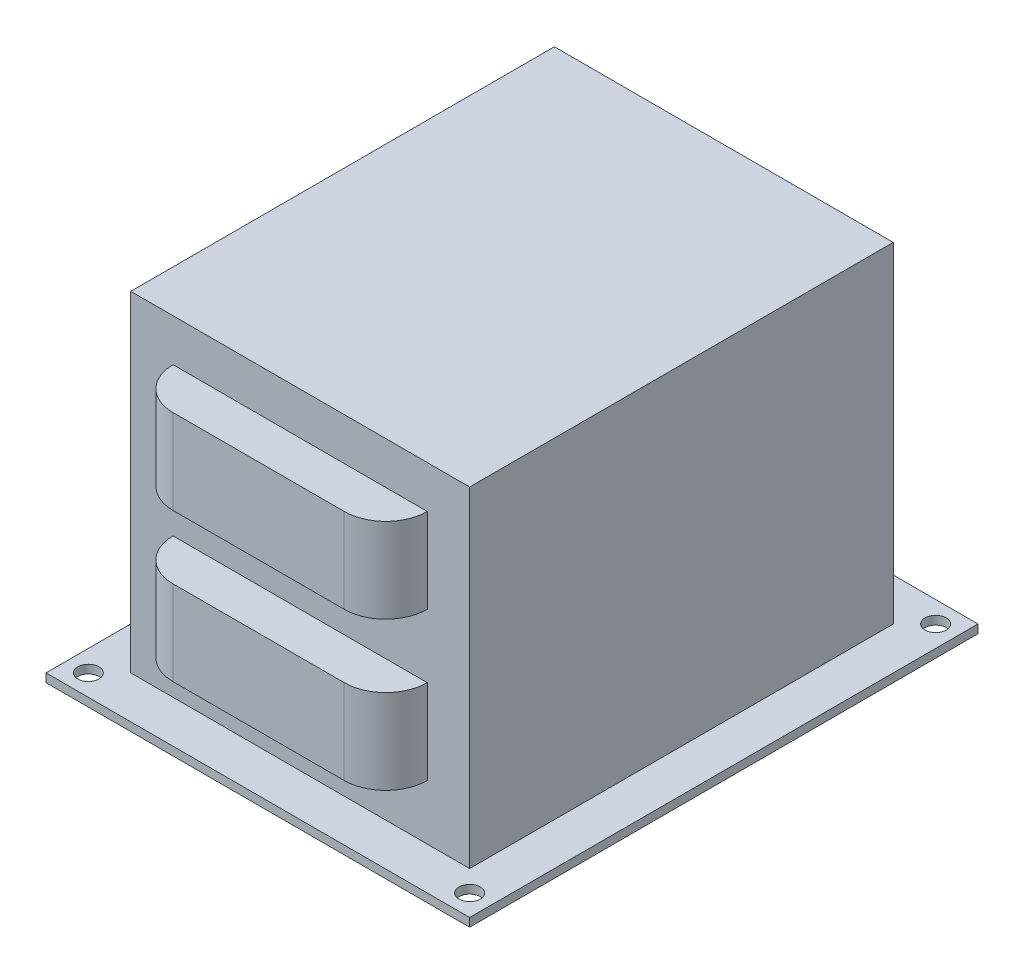
ISO-10303-21;
HEADER;
FILE_DESCRIPTION(('STEP AP214'),'2;1');
FILE_NAME('part.step','',(''),(''),'','','');
FILE_SCHEMA(('AUTOMOTIVE_DESIGN { 1 0 10303 214 1 1 1 1 }'));
ENDSEC;
DATA;
#1=APPLICATION_CONTEXT('core data for automotive mechanical design processes');
#2=APPLICATION_PROTOCOL_DEFINITION('international standard','automotive_design',2000,#1);
#3=PRODUCT_CONTEXT('',#1,'mechanical');
#4=PRODUCT('Part','Part','',(#3));
#5=PRODUCT_RELATED_PRODUCT_CATEGORY('part','',(#4));
#6=PRODUCT_DEFINITION_FORMATION('','',#4);
#7=PRODUCT_DEFINITION_CONTEXT('part definition',#1,'design');
#8=PRODUCT_DEFINITION('design','',#6,#7);
#9=PRODUCT_DEFINITION_SHAPE('','',#8);
#10=(LENGTH_UNIT() NAMED_UNIT(*) SI_UNIT(.MILLI.,.METRE.));
#11=(NAMED_UNIT(*) PLANE_ANGLE_UNIT() SI_UNIT($,.RADIAN.));
#12=(NAMED_UNIT(*) SI_UNIT($,.STERADIAN.) SOLID_ANGLE_UNIT());
#13=UNCERTAINTY_MEASURE_WITH_UNIT(LENGTH_MEASURE(1.E-05),#10,'distance_accuracy_value','');
#14=(GEOMETRIC_REPRESENTATION_CONTEXT(3) GLOBAL_UNCERTAINTY_ASSIGNED_CONTEXT((#13)) GLOBAL_UNIT_ASSIGNED_CONTEXT((#10,
#11,#12)) REPRESENTATION_CONTEXT('',''));
#15=CARTESIAN_POINT('',(0.,0.,0.));
#16=DIRECTION('',(0.,0.,1.));
#17=DIRECTION('',(1.,0.,0.));
#18=AXIS2_PLACEMENT_3D('',#15,#16,#17);
#19=CARTESIAN_POINT('',(0.,101.6,63.5));
#20=DIRECTION('',(0.,0.,-1.));
#21=DIRECTION('',(-1.,0.,0.));
#22=AXIS2_PLACEMENT_3D('',#19,#20,#21);
#23=PLANE('',#22);
#24=DIRECTION('',(0.,-1.,0.));
#25=VECTOR('',#24,1.);
#26=CARTESIAN_POINT('',(-38.0999999999999,44.45,63.5));
#27=LINE('',#26,#25);
#28=CARTESIAN_POINT('',(-38.0999999999999,44.45,63.5));
#29=VERTEX_POINT('',#28);
#30=CARTESIAN_POINT('',(-38.0999999999999,19.05,63.5));
#31=VERTEX_POINT('',#30);
#32=EDGE_CURVE('E67',#29,#31,#27,.T.);
#33=ORIENTED_EDGE('',*,*,#32,.F.);
#34=DIRECTION('',(1.,0.,0.));
#35=VECTOR('',#34,1.);
#36=CARTESIAN_POINT('',(0.,44.45,63.5));
#37=LINE('',#36,#35);
#38=CARTESIAN_POINT('',(38.1000000000001,44.45,63.5));
#39=VERTEX_POINT('',#38);
#40=EDGE_CURVE('E268',#29,#39,#37,.T.);
#41=ORIENTED_EDGE('',*,*,#40,.T.);
#42=DIRECTION('',(0.,-1.,0.));
#43=VECTOR('',#42,1.);
#44=CARTESIAN_POINT('',(38.1000000000001,44.45,63.5));
#45=LINE('',#44,#43);
#46=CARTESIAN_POINT('',(38.1000000000001,19.05,63.5));
#47=VERTEX_POINT('',#46);
#48=EDGE_CURVE('E287',#39,#47,#45,.T.);
#49=ORIENTED_EDGE('',*,*,#48,.T.);
#50=DIRECTION('',(1.,0.,0.));
#51=VECTOR('',#50,1.);
#52=CARTESIAN_POINT('',(0.,19.05,63.5));
#53=LINE('',#52,#51);
#54=EDGE_CURVE('E260',#31,#47,#53,.T.);
#55=ORIENTED_EDGE('',*,*,#54,.F.);
#56=EDGE_LOOP('',(#33,#41,#49,#55));
#57=FACE_BOUND('',#56,.T.);
#58=DIRECTION('',(-1.,0.,0.));
#59=VECTOR('',#58,1.);
#60=CARTESIAN_POINT('',(0.,2.54,63.5));
#61=LINE('',#60,#59);
#62=CARTESIAN_POINT('',(50.8,2.54,63.5));
#63=VERTEX_POINT('',#62);
#64=CARTESIAN_POINT('',(-50.8,2.54,63.5));
#65=VERTEX_POINT('',#64);
#66=EDGE_CURVE('E411',#63,#65,#61,.T.);
#67=ORIENTED_EDGE('',*,*,#66,.F.);
#68=DIRECTION('',(0.,-1.,0.));
#69=VECTOR('',#68,1.);
#70=CARTESIAN_POINT('',(50.8,101.6,63.5));
#71=LINE('',#70,#69);
#72=CARTESIAN_POINT('',(50.8,101.6,63.5));
#73=VERTEX_POINT('',#72);
#74=EDGE_CURVE('E396',#73,#63,#71,.T.);
#75=ORIENTED_EDGE('',*,*,#74,.F.);
#76=DIRECTION('',(1.,0.,0.));
#77=VECTOR('',#76,1.);
#78=CARTESIAN_POINT('',(0.,101.6,63.5));
#79=LINE('',#78,#77);
#80=CARTESIAN_POINT('',(-50.8,101.6,63.5));
#81=VERTEX_POINT('',#80);
#82=EDGE_CURVE('E393',#81,#73,#79,.T.);
#83=ORIENTED_EDGE('',*,*,#82,.F.);
#84=DIRECTION('',(0.,-1.,0.));
#85=VECTOR('',#84,1.);
#86=CARTESIAN_POINT('',(-50.8,101.6,63.5));
#87=LINE('',#86,#85);
#88=EDGE_CURVE('E400',#81,#65,#87,.T.);
#89=ORIENTED_EDGE('',*,*,#88,.T.);
#90=EDGE_LOOP('',(#67,#75,#83,#89));
#91=FACE_BOUND('',#90,.T.);
#92=DIRECTION('',(0.,-1.,0.));
#93=VECTOR('',#92,1.);
#94=CARTESIAN_POINT('',(38.1000000000001,178.809733298335,63.5));
#95=LINE('',#94,#93);
#96=CARTESIAN_POINT('',(38.1000000000001,88.9,63.5));
#97=VERTEX_POINT('',#96);
#98=CARTESIAN_POINT('',(38.1000000000001,63.5,63.5));
#99=VERTEX_POINT('',#98);
#100=EDGE_CURVE('E362',#97,#99,#95,.T.);
#101=ORIENTED_EDGE('',*,*,#100,.T.);
#102=DIRECTION('',(1.,0.,0.));
#103=VECTOR('',#102,1.);
#104=CARTESIAN_POINT('',(0.,63.5,63.5));
#105=LINE('',#104,#103);
#106=CARTESIAN_POINT('',(-38.0999999999999,63.5,63.5));
#107=VERTEX_POINT('',#106);
#108=EDGE_CURVE('E341',#107,#99,#105,.T.);
#109=ORIENTED_EDGE('',*,*,#108,.F.);
#110=DIRECTION('',(0.,-1.,0.));
#111=VECTOR('',#110,1.);
#112=CARTESIAN_POINT('',(-38.0999999999999,178.809733298335,63.5));
#113=LINE('',#112,#111);
#114=CARTESIAN_POINT('',(-38.0999999999999,88.9,63.5));
#115=VERTEX_POINT('',#114);
#116=EDGE_CURVE('E366',#115,#107,#113,.T.);
#117=ORIENTED_EDGE('',*,*,#116,.F.);
#118=DIRECTION('',(1.,0.,0.));
#119=VECTOR('',#118,1.);
#120=CARTESIAN_POINT('',(0.,88.9,63.5));
#121=LINE('',#120,#119);
#122=EDGE_CURVE('E355',#115,#97,#121,.T.);
#123=ORIENTED_EDGE('',*,*,#122,.T.);
#124=EDGE_LOOP('',(#101,#109,#117,#123));
#125=FACE_BOUND('',#124,.T.);
#126=ADVANCED_FACE('F43',(#57,#91,#125),#23,.F.);
#127=CARTESIAN_POINT('',(63.5,2.54,0.));
#128=DIRECTION('',(1.,0.,0.));
#129=DIRECTION('',(0.,0.,-1.));
#130=AXIS2_PLACEMENT_3D('',#127,#128,#129);
#131=PLANE('',#130);
#132=DIRECTION('',(0.,0.,1.));
#133=VECTOR('',#132,1.);
#134=CARTESIAN_POINT('',(63.5,0.,0.));
#135=LINE('',#134,#133);
#136=CARTESIAN_POINT('',(63.5,0.,-76.2));
#137=VERTEX_POINT('',#136);
#138=CARTESIAN_POINT('',(63.5,0.,76.2));
#139=VERTEX_POINT('',#138);
#140=EDGE_CURVE('E466',#137,#139,#135,.T.);
#141=ORIENTED_EDGE('',*,*,#140,.F.);
#142=DIRECTION('',(0.,-1.,0.));
#143=VECTOR('',#142,1.);
#144=CARTESIAN_POINT('',(63.5,2.54,-76.2));
#145=LINE('',#144,#143);
#146=CARTESIAN_POINT('',(63.5,2.54,-76.2));
#147=VERTEX_POINT('',#146);
#148=EDGE_CURVE('E12',#147,#137,#145,.T.);
#149=ORIENTED_EDGE('',*,*,#148,.F.);
#150=DIRECTION('',(0.,0.,1.));
#151=VECTOR('',#150,1.);
#152=CARTESIAN_POINT('',(63.5,2.54,0.));
#153=LINE('',#152,#151);
#154=CARTESIAN_POINT('',(63.5,2.54,76.2));
#155=VERTEX_POINT('',#154);
#156=EDGE_CURVE('E435',#147,#155,#153,.T.);
#157=ORIENTED_EDGE('',*,*,#156,.T.);
#158=DIRECTION('',(0.,-1.,0.));
#159=VECTOR('',#158,1.);
#160=CARTESIAN_POINT('',(63.5,2.54,76.2));
#161=LINE('',#160,#159);
#162=EDGE_CURVE('E458',#155,#139,#161,.T.);
#163=ORIENTED_EDGE('',*,*,#162,.T.);
#164=EDGE_LOOP('',(#141,#149,#157,#163));
#165=FACE_BOUND('',#164,.T.);
#166=ADVANCED_FACE('F510',(#165),#131,.T.);
#167=CARTESIAN_POINT('',(0.,2.54,-76.2));
#168=DIRECTION('',(0.,0.,-1.));
#169=DIRECTION('',(-1.,0.,0.));
#170=AXIS2_PLACEMENT_3D('',#167,#168,#169);
#171=PLANE('',#170);
#172=DIRECTION('',(1.,0.,0.));
#173=VECTOR('',#172,1.);
#174=CARTESIAN_POINT('',(0.,0.,-76.2));
#175=LINE('',#174,#173);
#176=CARTESIAN_POINT('',(-63.5,0.,-76.2));
#177=VERTEX_POINT('',#176);
#178=EDGE_CURVE('E470',#177,#137,#175,.T.);
#179=ORIENTED_EDGE('',*,*,#178,.F.);
#180=DIRECTION('',(0.,-1.,0.));
#181=VECTOR('',#180,1.);
#182=CARTESIAN_POINT('',(-63.5,2.54,-76.2));
#183=LINE('',#182,#181);
#184=CARTESIAN_POINT('',(-63.5,2.54,-76.2));
#185=VERTEX_POINT('',#184);
#186=EDGE_CURVE('E52',#185,#177,#183,.T.);
#187=ORIENTED_EDGE('',*,*,#186,.F.);
#188=DIRECTION('',(1.,0.,0.));
#189=VECTOR('',#188,1.);
#190=CARTESIAN_POINT('',(0.,2.54,-76.2));
#191=LINE('',#190,#189);
#192=EDGE_CURVE('E439',#185,#147,#191,.T.);
#193=ORIENTED_EDGE('',*,*,#192,.T.);
#194=ORIENTED_EDGE('',*,*,#148,.T.);
#195=EDGE_LOOP('',(#179,#187,#193,#194));
#196=FACE_BOUND('',#195,.T.);
#197=ADVANCED_FACE('F506',(#196),#171,.T.);
#198=CARTESIAN_POINT('',(-63.5,2.54,0.));
#199=DIRECTION('',(1.,0.,0.));
#200=DIRECTION('',(0.,0.,-1.));
#201=AXIS2_PLACEMENT_3D('',#198,#199,#200);
#202=PLANE('',#201);
#203=DIRECTION('',(0.,0.,1.));
#204=VECTOR('',#203,1.);
#205=CARTESIAN_POINT('',(-63.5,0.,0.));
#206=LINE('',#205,#204);
#207=CARTESIAN_POINT('',(-63.5,0.,76.2));
#208=VERTEX_POINT('',#207);
#209=EDGE_CURVE('E474',#177,#208,#206,.T.);
#210=ORIENTED_EDGE('',*,*,#209,.T.);
#211=DIRECTION('',(0.,-1.,0.));
#212=VECTOR('',#211,1.);
#213=CARTESIAN_POINT('',(-63.5,2.54,76.2));
#214=LINE('',#213,#212);
#215=CARTESIAN_POINT('',(-63.5,2.54,76.2));
#216=VERTEX_POINT('',#215);
#217=EDGE_CURVE('E491',#216,#208,#214,.T.);
#218=ORIENTED_EDGE('',*,*,#217,.F.);
#219=DIRECTION('',(0.,0.,1.));
#220=VECTOR('',#219,1.);
#221=CARTESIAN_POINT('',(-63.5,2.54,0.));
#222=LINE('',#221,#220);
#223=EDGE_CURVE('E443',#185,#216,#222,.T.);
#224=ORIENTED_EDGE('',*,*,#223,.F.);
#225=ORIENTED_EDGE('',*,*,#186,.T.);
#226=EDGE_LOOP('',(#210,#218,#224,#225));
#227=FACE_BOUND('',#226,.T.);
#228=ADVANCED_FACE('F498',(#227),#202,.F.);
#229=CARTESIAN_POINT('',(57.1500000000001,2.54,69.85));
#230=DIRECTION('',(0.,-1.,0.));
#231=DIRECTION('',(0.,0.,-1.));
#232=AXIS2_PLACEMENT_3D('',#229,#230,#231);
#233=CYLINDRICAL_SURFACE('',#232,3.175);
#234=CARTESIAN_POINT('',(57.1500000000001,2.54,69.85));
#235=DIRECTION('',(0.,1.,0.));
#236=DIRECTION('',(0.,0.,1.));
#237=AXIS2_PLACEMENT_3D('',#234,#235,#236);
#238=CIRCLE('',#237,3.175);
#239=CARTESIAN_POINT('',(57.1500000000001,2.54,73.025));
#240=VERTEX_POINT('',#239);
#241=EDGE_CURVE('E450',#240,#240,#238,.T.);
#242=ORIENTED_EDGE('',*,*,#241,.T.);
#243=EDGE_LOOP('',(#242));
#244=FACE_BOUND('',#243,.T.);
#245=CARTESIAN_POINT('',(57.1500000000001,0.,69.85));
#246=DIRECTION('',(0.,1.,0.));
#247=DIRECTION('',(0.,0.,1.));
#248=AXIS2_PLACEMENT_3D('',#245,#246,#247);
#249=CIRCLE('',#248,3.175);
#250=CARTESIAN_POINT('',(57.1500000000001,0.,73.025));
#251=VERTEX_POINT('',#250);
#252=EDGE_CURVE('E482',#251,#251,#249,.T.);
#253=ORIENTED_EDGE('',*,*,#252,.F.);
#254=EDGE_LOOP('',(#253));
#255=FACE_BOUND('',#254,.T.);
#256=ADVANCED_FACE('F667',(#244,#255),#233,.F.);
#257=CARTESIAN_POINT('',(0.,2.54,76.2));
#258=DIRECTION('',(0.,0.,-1.));
#259=DIRECTION('',(-1.,0.,0.));
#260=AXIS2_PLACEMENT_3D('',#257,#258,#259);
#261=PLANE('',#260);
#262=DIRECTION('',(1.,0.,0.));
#263=VECTOR('',#262,1.);
#264=CARTESIAN_POINT('',(0.,0.,76.2));
#265=LINE('',#264,#263);
#266=EDGE_CURVE('E478',#208,#139,#265,.T.);
#267=ORIENTED_EDGE('',*,*,#266,.T.);
#268=ORIENTED_EDGE('',*,*,#162,.F.);
#269=DIRECTION('',(1.,0.,0.));
#270=VECTOR('',#269,1.);
#271=CARTESIAN_POINT('',(0.,2.54,76.2));
#272=LINE('',#271,#270);
#273=EDGE_CURVE('E447',#216,#155,#272,.T.);
#274=ORIENTED_EDGE('',*,*,#273,.F.);
#275=ORIENTED_EDGE('',*,*,#217,.T.);
#276=EDGE_LOOP('',(#267,#268,#274,#275));
#277=FACE_BOUND('',#276,.T.);
#278=ADVANCED_FACE('F513',(#277),#261,.F.);
#279=CARTESIAN_POINT('',(-57.15,2.54,-69.85));
#280=DIRECTION('',(0.,-1.,0.));
#281=DIRECTION('',(0.,0.,-1.));
#282=AXIS2_PLACEMENT_3D('',#279,#280,#281);
#283=CYLINDRICAL_SURFACE('',#282,3.175);
#284=CARTESIAN_POINT('',(-57.15,2.54,-69.85));
#285=DIRECTION('',(0.,1.,0.));
#286=DIRECTION('',(0.,0.,1.));
#287=AXIS2_PLACEMENT_3D('',#284,#285,#286);
#288=CIRCLE('',#287,3.175);
#289=CARTESIAN_POINT('',(-57.15,2.54,-66.675));
#290=VERTEX_POINT('',#289);
#291=EDGE_CURVE('E430',#290,#290,#288,.T.);
#292=ORIENTED_EDGE('',*,*,#291,.T.);
#293=EDGE_LOOP('',(#292));
#294=FACE_BOUND('',#293,.T.);
#295=CARTESIAN_POINT('',(-57.15,0.,-69.85));
#296=DIRECTION('',(0.,1.,0.));
#297=DIRECTION('',(0.,0.,1.));
#298=AXIS2_PLACEMENT_3D('',#295,#296,#297);
#299=CIRCLE('',#298,3.175);
#300=CARTESIAN_POINT('',(-57.15,0.,-66.675));
#301=VERTEX_POINT('',#300);
#302=EDGE_CURVE('E462',#301,#301,#299,.T.);
#303=ORIENTED_EDGE('',*,*,#302,.F.);
#304=EDGE_LOOP('',(#303));
#305=FACE_BOUND('',#304,.T.);
#306=ADVANCED_FACE('F650',(#294,#305),#283,.F.);
#307=CARTESIAN_POINT('',(57.15,2.54,-69.85));
#308=DIRECTION('',(0.,-1.,0.));
#309=DIRECTION('',(0.,0.,-1.));
#310=AXIS2_PLACEMENT_3D('',#307,#308,#309);
#311=CYLINDRICAL_SURFACE('',#310,3.175);
#312=CARTESIAN_POINT('',(57.15,2.54,-69.85));
#313=DIRECTION('',(0.,1.,0.));
#314=DIRECTION('',(0.,0.,1.));
#315=AXIS2_PLACEMENT_3D('',#312,#313,#314);
#316=CIRCLE('',#315,3.175);
#317=CARTESIAN_POINT('',(57.15,2.54,-66.675));
#318=VERTEX_POINT('',#317);
#319=EDGE_CURVE('E426',#318,#318,#316,.F.);
#320=ORIENTED_EDGE('',*,*,#319,.F.);
#321=EDGE_LOOP('',(#320));
#322=FACE_BOUND('',#321,.T.);
#323=CARTESIAN_POINT('',(57.15,0.,-69.85));
#324=DIRECTION('',(0.,1.,0.));
#325=DIRECTION('',(0.,0.,1.));
#326=AXIS2_PLACEMENT_3D('',#323,#324,#325);
#327=CIRCLE('',#326,3.175);
#328=CARTESIAN_POINT('',(57.15,0.,-66.675));
#329=VERTEX_POINT('',#328);
#330=EDGE_CURVE('E425',#329,#329,#327,.F.);
#331=ORIENTED_EDGE('',*,*,#330,.T.);
#332=EDGE_LOOP('',(#331));
#333=FACE_BOUND('',#332,.T.);
#334=ADVANCED_FACE('F45',(#322,#333),#311,.F.);
#335=CARTESIAN_POINT('',(-57.15,2.54,69.8500000000001));
#336=DIRECTION('',(0.,-1.,0.));
#337=DIRECTION('',(0.,0.,-1.));
#338=AXIS2_PLACEMENT_3D('',#335,#336,#337);
#339=CYLINDRICAL_SURFACE('',#338,3.175);
#340=CARTESIAN_POINT('',(-57.15,2.54,69.8500000000001));
#341=DIRECTION('',(0.,1.,0.));
#342=DIRECTION('',(0.,0.,1.));
#343=AXIS2_PLACEMENT_3D('',#340,#341,#342);
#344=CIRCLE('',#343,3.175);
#345=CARTESIAN_POINT('',(-57.15,2.54,73.0250000000001));
#346=VERTEX_POINT('',#345);
#347=EDGE_CURVE('E454',#346,#346,#344,.F.);
#348=ORIENTED_EDGE('',*,*,#347,.F.);
#349=EDGE_LOOP('',(#348));
#350=FACE_BOUND('',#349,.T.);
#351=CARTESIAN_POINT('',(-57.15,0.,69.8500000000001));
#352=DIRECTION('',(0.,1.,0.));
#353=DIRECTION('',(0.,0.,1.));
#354=AXIS2_PLACEMENT_3D('',#351,#352,#353);
#355=CIRCLE('',#354,3.175);
#356=CARTESIAN_POINT('',(-57.15,0.,73.0250000000001));
#357=VERTEX_POINT('',#356);
#358=EDGE_CURVE('E431',#357,#357,#355,.F.);
#359=ORIENTED_EDGE('',*,*,#358,.T.);
#360=EDGE_LOOP('',(#359));
#361=FACE_BOUND('',#360,.T.);
#362=ADVANCED_FACE('F518',(#350,#361),#339,.F.);
#363=CARTESIAN_POINT('',(0.,2.54,0.));
#364=DIRECTION('',(0.,1.,0.));
#365=DIRECTION('',(0.,0.,1.));
#366=AXIS2_PLACEMENT_3D('',#363,#364,#365);
#367=PLANE('',#366);
#368=DIRECTION('',(0.,0.,-1.));
#369=VECTOR('',#368,1.);
#370=CARTESIAN_POINT('',(50.8,2.54,0.));
#371=LINE('',#370,#369);
#372=CARTESIAN_POINT('',(50.8,2.54,-63.5));
#373=VERTEX_POINT('',#372);
#374=EDGE_CURVE('E422',#63,#373,#371,.T.);
#375=ORIENTED_EDGE('',*,*,#374,.F.);
#376=ORIENTED_EDGE('',*,*,#66,.T.);
#377=DIRECTION('',(0.,0.,-1.));
#378=VECTOR('',#377,1.);
#379=CARTESIAN_POINT('',(-50.8,2.54,0.));
#380=LINE('',#379,#378);
#381=CARTESIAN_POINT('',(-50.8,2.54,-63.5));
#382=VERTEX_POINT('',#381);
#383=EDGE_CURVE('E415',#65,#382,#380,.T.);
#384=ORIENTED_EDGE('',*,*,#383,.T.);
#385=DIRECTION('',(-1.,0.,0.));
#386=VECTOR('',#385,1.);
#387=CARTESIAN_POINT('',(0.,2.54,-63.5));
#388=LINE('',#387,#386);
#389=EDGE_CURVE('E419',#373,#382,#388,.T.);
#390=ORIENTED_EDGE('',*,*,#389,.F.);
#391=EDGE_LOOP('',(#375,#376,#384,#390));
#392=FACE_BOUND('',#391,.T.);
#393=ORIENTED_EDGE('',*,*,#319,.T.);
#394=EDGE_LOOP('',(#393));
#395=FACE_BOUND('',#394,.T.);
#396=ORIENTED_EDGE('',*,*,#291,.F.);
#397=EDGE_LOOP('',(#396));
#398=FACE_BOUND('',#397,.T.);
#399=ORIENTED_EDGE('',*,*,#156,.F.);
#400=ORIENTED_EDGE('',*,*,#192,.F.);
#401=ORIENTED_EDGE('',*,*,#223,.T.);
#402=ORIENTED_EDGE('',*,*,#273,.T.);
#403=EDGE_LOOP('',(#399,#400,#401,#402));
#404=FACE_BOUND('',#403,.T.);
#405=ORIENTED_EDGE('',*,*,#241,.F.);
#406=EDGE_LOOP('',(#405));
#407=FACE_BOUND('',#406,.T.);
#408=ORIENTED_EDGE('',*,*,#347,.T.);
#409=EDGE_LOOP('',(#408));
#410=FACE_BOUND('',#409,.T.);
#411=ADVANCED_FACE('F515',(#392,#395,#398,#404,#407,#410),#367,.T.);
#412=CARTESIAN_POINT('',(0.,0.,0.));
#413=DIRECTION('',(0.,1.,0.));
#414=DIRECTION('',(0.,0.,1.));
#415=AXIS2_PLACEMENT_3D('',#412,#413,#414);
#416=PLANE('',#415);
#417=ORIENTED_EDGE('',*,*,#330,.F.);
#418=EDGE_LOOP('',(#417));
#419=FACE_BOUND('',#418,.T.);
#420=ORIENTED_EDGE('',*,*,#302,.T.);
#421=EDGE_LOOP('',(#420));
#422=FACE_BOUND('',#421,.T.);
#423=ORIENTED_EDGE('',*,*,#140,.T.);
#424=ORIENTED_EDGE('',*,*,#266,.F.);
#425=ORIENTED_EDGE('',*,*,#209,.F.);
#426=ORIENTED_EDGE('',*,*,#178,.T.);
#427=EDGE_LOOP('',(#423,#424,#425,#426));
#428=FACE_BOUND('',#427,.T.);
#429=ORIENTED_EDGE('',*,*,#252,.T.);
#430=EDGE_LOOP('',(#429));
#431=FACE_BOUND('',#430,.T.);
#432=ORIENTED_EDGE('',*,*,#358,.F.);
#433=EDGE_LOOP('',(#432));
#434=FACE_BOUND('',#433,.T.);
#435=ADVANCED_FACE('F504',(#419,#422,#428,#431,#434),#416,.F.);
#436=CARTESIAN_POINT('',(50.8,101.6,0.));
#437=DIRECTION('',(1.,0.,0.));
#438=DIRECTION('',(0.,0.,-1.));
#439=AXIS2_PLACEMENT_3D('',#436,#437,#438);
#440=PLANE('',#439);
#441=ORIENTED_EDGE('',*,*,#74,.T.);
#442=ORIENTED_EDGE('',*,*,#374,.T.);
#443=DIRECTION('',(0.,-1.,0.));
#444=VECTOR('',#443,1.);
#445=CARTESIAN_POINT('',(50.8,101.6,-63.5));
#446=LINE('',#445,#444);
#447=CARTESIAN_POINT('',(50.8,101.6,-63.5));
#448=VERTEX_POINT('',#447);
#449=EDGE_CURVE('E407',#448,#373,#446,.T.);
#450=ORIENTED_EDGE('',*,*,#449,.F.);
#451=DIRECTION('',(0.,0.,1.));
#452=VECTOR('',#451,1.);
#453=CARTESIAN_POINT('',(50.8,101.6,0.));
#454=LINE('',#453,#452);
#455=EDGE_CURVE('E382',#448,#73,#454,.T.);
#456=ORIENTED_EDGE('',*,*,#455,.T.);
#457=EDGE_LOOP('',(#441,#442,#450,#456));
#458=FACE_BOUND('',#457,.T.);
#459=ADVANCED_FACE('F531',(#458),#440,.T.);
#460=CARTESIAN_POINT('',(0.,101.6,-63.5));
#461=DIRECTION('',(0.,0.,-1.));
#462=DIRECTION('',(-1.,0.,0.));
#463=AXIS2_PLACEMENT_3D('',#460,#461,#462);
#464=PLANE('',#463);
#465=DIRECTION('',(1.,0.,0.));
#466=VECTOR('',#465,1.);
#467=CARTESIAN_POINT('',(0.,44.45,-63.5));
#468=LINE('',#467,#466);
#469=CARTESIAN_POINT('',(-38.1,44.45,-63.5));
#470=VERTEX_POINT('',#469);
#471=CARTESIAN_POINT('',(38.1,44.45,-63.5));
#472=VERTEX_POINT('',#471);
#473=EDGE_CURVE('E227',#470,#472,#468,.T.);
#474=ORIENTED_EDGE('',*,*,#473,.F.);
#475=DIRECTION('',(0.,-1.,0.));
#476=VECTOR('',#475,1.);
#477=CARTESIAN_POINT('',(-38.1,44.45,-63.5));
#478=LINE('',#477,#476);
#479=CARTESIAN_POINT('',(-38.1,19.05,-63.5));
#480=VERTEX_POINT('',#479);
#481=EDGE_CURVE('E250',#470,#480,#478,.T.);
#482=ORIENTED_EDGE('',*,*,#481,.T.);
#483=DIRECTION('',(1.,0.,0.));
#484=VECTOR('',#483,1.);
#485=CARTESIAN_POINT('',(0.,19.05,-63.5));
#486=LINE('',#485,#484);
#487=CARTESIAN_POINT('',(38.1,19.05,-63.5));
#488=VERTEX_POINT('',#487);
#489=EDGE_CURVE('E229',#480,#488,#486,.T.);
#490=ORIENTED_EDGE('',*,*,#489,.T.);
#491=DIRECTION('',(0.,-1.,0.));
#492=VECTOR('',#491,1.);
#493=CARTESIAN_POINT('',(38.1,44.45,-63.5));
#494=LINE('',#493,#492);
#495=EDGE_CURVE('E240',#472,#488,#494,.T.);
#496=ORIENTED_EDGE('',*,*,#495,.F.);
#497=EDGE_LOOP('',(#474,#482,#490,#496));
#498=FACE_BOUND('',#497,.T.);
#499=DIRECTION('',(1.,0.,0.));
#500=VECTOR('',#499,1.);
#501=CARTESIAN_POINT('',(-38.1,63.5,-63.5));
#502=LINE('',#501,#500);
#503=CARTESIAN_POINT('',(-38.1,63.5,-63.5));
#504=VERTEX_POINT('',#503);
#505=CARTESIAN_POINT('',(38.1,63.5,-63.5));
#506=VERTEX_POINT('',#505);
#507=EDGE_CURVE('E307',#504,#506,#502,.T.);
#508=ORIENTED_EDGE('',*,*,#507,.T.);
#509=DIRECTION('',(0.,-1.,0.));
#510=VECTOR('',#509,1.);
#511=CARTESIAN_POINT('',(38.1,178.809733298335,-63.5));
#512=LINE('',#511,#510);
#513=CARTESIAN_POINT('',(38.1,88.9,-63.5));
#514=VERTEX_POINT('',#513);
#515=EDGE_CURVE('E297',#514,#506,#512,.T.);
#516=ORIENTED_EDGE('',*,*,#515,.F.);
#517=DIRECTION('',(1.,0.,0.));
#518=VECTOR('',#517,1.);
#519=CARTESIAN_POINT('',(-38.1,88.9,-63.5));
#520=LINE('',#519,#518);
#521=CARTESIAN_POINT('',(-38.1,88.9,-63.5));
#522=VERTEX_POINT('',#521);
#523=EDGE_CURVE('E296',#522,#514,#520,.T.);
#524=ORIENTED_EDGE('',*,*,#523,.F.);
#525=DIRECTION('',(0.,-1.,0.));
#526=VECTOR('',#525,1.);
#527=CARTESIAN_POINT('',(-38.1,178.809733298335,-63.5));
#528=LINE('',#527,#526);
#529=EDGE_CURVE('E303',#522,#504,#528,.T.);
#530=ORIENTED_EDGE('',*,*,#529,.T.);
#531=EDGE_LOOP('',(#508,#516,#524,#530));
#532=FACE_BOUND('',#531,.T.);
#533=ORIENTED_EDGE('',*,*,#449,.T.);
#534=ORIENTED_EDGE('',*,*,#389,.T.);
#535=DIRECTION('',(0.,-1.,0.));
#536=VECTOR('',#535,1.);
#537=CARTESIAN_POINT('',(-50.8,101.6,-63.5));
#538=LINE('',#537,#536);
#539=CARTESIAN_POINT('',(-50.8,101.6,-63.5));
#540=VERTEX_POINT('',#539);
#541=EDGE_CURVE('E403',#540,#382,#538,.T.);
#542=ORIENTED_EDGE('',*,*,#541,.F.);
#543=DIRECTION('',(1.,0.,0.));
#544=VECTOR('',#543,1.);
#545=CARTESIAN_POINT('',(0.,101.6,-63.5));
#546=LINE('',#545,#544);
#547=EDGE_CURVE('E386',#540,#448,#546,.T.);
#548=ORIENTED_EDGE('',*,*,#547,.T.);
#549=EDGE_LOOP('',(#533,#534,#542,#548));
#550=FACE_BOUND('',#549,.T.);
#551=ADVANCED_FACE('F537',(#498,#532,#550),#464,.T.);
#552=CARTESIAN_POINT('',(-50.8,101.6,0.));
#553=DIRECTION('',(1.,0.,0.));
#554=DIRECTION('',(0.,0.,-1.));
#555=AXIS2_PLACEMENT_3D('',#552,#553,#554);
#556=PLANE('',#555);
#557=ORIENTED_EDGE('',*,*,#383,.F.);
#558=ORIENTED_EDGE('',*,*,#88,.F.);
#559=DIRECTION('',(0.,0.,1.));
#560=VECTOR('',#559,1.);
#561=CARTESIAN_POINT('',(-50.8,101.6,0.));
#562=LINE('',#561,#560);
#563=EDGE_CURVE('E390',#540,#81,#562,.T.);
#564=ORIENTED_EDGE('',*,*,#563,.F.);
#565=ORIENTED_EDGE('',*,*,#541,.T.);
#566=EDGE_LOOP('',(#557,#558,#564,#565));
#567=FACE_BOUND('',#566,.T.);
#568=ADVANCED_FACE('F553',(#567),#556,.F.);
#569=CARTESIAN_POINT('',(0.,101.6,0.));
#570=DIRECTION('',(0.,1.,0.));
#571=DIRECTION('',(0.,0.,1.));
#572=AXIS2_PLACEMENT_3D('',#569,#570,#571);
#573=PLANE('',#572);
#574=ORIENTED_EDGE('',*,*,#455,.F.);
#575=ORIENTED_EDGE('',*,*,#547,.F.);
#576=ORIENTED_EDGE('',*,*,#563,.T.);
#577=ORIENTED_EDGE('',*,*,#82,.T.);
#578=EDGE_LOOP('',(#574,#575,#576,#577));
#579=FACE_BOUND('',#578,.T.);
#580=ADVANCED_FACE('F551',(#579),#573,.T.);
#581=CARTESIAN_POINT('',(0.,88.9,0.));
#582=DIRECTION('',(0.,1.,0.));
#583=DIRECTION('',(0.,0.,1.));
#584=AXIS2_PLACEMENT_3D('',#581,#582,#583);
#585=PLANE('',#584);
#586=CARTESIAN_POINT('',(-25.6539999999999,88.9,63.5000000000001));
#587=DIRECTION('',(0.,1.,0.));
#588=DIRECTION('',(0.,0.,1.));
#589=AXIS2_PLACEMENT_3D('',#586,#587,#588);
#590=CIRCLE('',#589,12.446);
#591=CARTESIAN_POINT('',(-25.6539999999999,88.9,75.9460000000001));
#592=VERTEX_POINT('',#591);
#593=EDGE_CURVE('E363',#592,#115,#590,.F.);
#594=ORIENTED_EDGE('',*,*,#593,.F.);
#595=DIRECTION('',(-1.,0.,0.));
#596=VECTOR('',#595,1.);
#597=CARTESIAN_POINT('',(0.,88.9,75.946));
#598=LINE('',#597,#596);
#599=CARTESIAN_POINT('',(25.6540000000001,88.9,75.946));
#600=VERTEX_POINT('',#599);
#601=EDGE_CURVE('E350',#600,#592,#598,.T.);
#602=ORIENTED_EDGE('',*,*,#601,.F.);
#603=CARTESIAN_POINT('',(25.6540000000001,88.9,63.5));
#604=DIRECTION('',(0.,1.,0.));
#605=DIRECTION('',(0.,0.,1.));
#606=AXIS2_PLACEMENT_3D('',#603,#604,#605);
#607=CIRCLE('',#606,12.446);
#608=EDGE_CURVE('E321',#600,#97,#607,.T.);
#609=ORIENTED_EDGE('',*,*,#608,.T.);
#610=ORIENTED_EDGE('',*,*,#122,.F.);
#611=EDGE_LOOP('',(#594,#602,#609,#610));
#612=FACE_BOUND('',#611,.T.);
#613=ADVANCED_FACE('F593',(#612),#585,.T.);
#614=CARTESIAN_POINT('',(0.,63.5,0.));
#615=DIRECTION('',(0.,1.,0.));
#616=DIRECTION('',(0.,0.,1.));
#617=AXIS2_PLACEMENT_3D('',#614,#615,#616);
#618=PLANE('',#617);
#619=CARTESIAN_POINT('',(-25.6539999999999,63.5,63.5000000000001));
#620=DIRECTION('',(0.,1.,0.));
#621=DIRECTION('',(0.,0.,1.));
#622=AXIS2_PLACEMENT_3D('',#619,#620,#621);
#623=CIRCLE('',#622,12.446);
#624=CARTESIAN_POINT('',(-25.6539999999999,63.5,75.9460000000001));
#625=VERTEX_POINT('',#624);
#626=EDGE_CURVE('E346',#625,#107,#623,.F.);
#627=ORIENTED_EDGE('',*,*,#626,.T.);
#628=ORIENTED_EDGE('',*,*,#108,.T.);
#629=CARTESIAN_POINT('',(25.6540000000001,63.5,63.5));
#630=DIRECTION('',(0.,1.,0.));
#631=DIRECTION('',(0.,0.,1.));
#632=AXIS2_PLACEMENT_3D('',#629,#630,#631);
#633=CIRCLE('',#632,12.446);
#634=CARTESIAN_POINT('',(25.6540000000001,63.5,75.946));
#635=VERTEX_POINT('',#634);
#636=EDGE_CURVE('E347',#635,#99,#633,.T.);
#637=ORIENTED_EDGE('',*,*,#636,.F.);
#638=DIRECTION('',(-1.,0.,0.));
#639=VECTOR('',#638,1.);
#640=CARTESIAN_POINT('',(0.,63.5,75.946));
#641=LINE('',#640,#639);
#642=EDGE_CURVE('E345',#635,#625,#641,.T.);
#643=ORIENTED_EDGE('',*,*,#642,.T.);
#644=EDGE_LOOP('',(#627,#628,#637,#643));
#645=FACE_BOUND('',#644,.T.);
#646=ADVANCED_FACE('F587',(#645),#618,.F.);
#647=CARTESIAN_POINT('',(25.6540000000001,178.809733298335,63.5));
#648=DIRECTION('',(0.,-1.,0.));
#649=DIRECTION('',(0.,0.,-1.));
#650=AXIS2_PLACEMENT_3D('',#647,#648,#649);
#651=CYLINDRICAL_SURFACE('',#650,12.446);
#652=ORIENTED_EDGE('',*,*,#608,.F.);
#653=DIRECTION('',(0.,-1.,0.));
#654=VECTOR('',#653,1.);
#655=CARTESIAN_POINT('',(25.6540000000001,178.809733298335,75.946));
#656=LINE('',#655,#654);
#657=EDGE_CURVE('E351',#600,#635,#656,.T.);
#658=ORIENTED_EDGE('',*,*,#657,.T.);
#659=ORIENTED_EDGE('',*,*,#636,.T.);
#660=ORIENTED_EDGE('',*,*,#100,.F.);
#661=EDGE_LOOP('',(#652,#658,#659,#660));
#662=FACE_BOUND('',#661,.T.);
#663=ADVANCED_FACE('F582',(#662),#651,.T.);
#664=CARTESIAN_POINT('',(0.,178.809733298335,75.946));
#665=DIRECTION('',(0.,0.,1.));
#666=DIRECTION('',(1.,0.,0.));
#667=AXIS2_PLACEMENT_3D('',#664,#665,#666);
#668=PLANE('',#667);
#669=ORIENTED_EDGE('',*,*,#657,.F.);
#670=ORIENTED_EDGE('',*,*,#601,.T.);
#671=DIRECTION('',(0.,-1.,0.));
#672=VECTOR('',#671,1.);
#673=CARTESIAN_POINT('',(-25.6539999999999,178.809733298335,75.9460000000001));
#674=LINE('',#673,#672);
#675=EDGE_CURVE('E367',#592,#625,#674,.T.);
#676=ORIENTED_EDGE('',*,*,#675,.T.);
#677=ORIENTED_EDGE('',*,*,#642,.F.);
#678=EDGE_LOOP('',(#669,#670,#676,#677));
#679=FACE_BOUND('',#678,.T.);
#680=ADVANCED_FACE('F595',(#679),#668,.T.);
#681=CARTESIAN_POINT('',(-25.6539999999999,178.809733298335,63.5000000000001));
#682=DIRECTION('',(0.,-1.,0.));
#683=DIRECTION('',(0.,0.,-1.));
#684=AXIS2_PLACEMENT_3D('',#681,#682,#683);
#685=CYLINDRICAL_SURFACE('',#684,12.446);
#686=ORIENTED_EDGE('',*,*,#675,.F.);
#687=ORIENTED_EDGE('',*,*,#593,.T.);
#688=ORIENTED_EDGE('',*,*,#116,.T.);
#689=ORIENTED_EDGE('',*,*,#626,.F.);
#690=EDGE_LOOP('',(#686,#687,#688,#689));
#691=FACE_BOUND('',#690,.T.);
#692=ADVANCED_FACE('F591',(#691),#685,.T.);
#693=CARTESIAN_POINT('',(25.654,178.809733298335,-63.5));
#694=DIRECTION('',(0.,-1.,0.));
#695=DIRECTION('',(0.,0.,-1.));
#696=AXIS2_PLACEMENT_3D('',#693,#694,#695);
#697=CYLINDRICAL_SURFACE('',#696,12.446);
#698=DIRECTION('',(0.,-1.,0.));
#699=VECTOR('',#698,1.);
#700=CARTESIAN_POINT('',(25.654,178.809733298335,-75.946));
#701=LINE('',#700,#699);
#702=CARTESIAN_POINT('',(25.654,88.9,-75.946));
#703=VERTEX_POINT('',#702);
#704=CARTESIAN_POINT('',(25.654,63.5,-75.946));
#705=VERTEX_POINT('',#704);
#706=EDGE_CURVE('E302',#703,#705,#701,.T.);
#707=ORIENTED_EDGE('',*,*,#706,.F.);
#708=CARTESIAN_POINT('',(25.654,88.9,-63.5));
#709=DIRECTION('',(0.,1.,0.));
#710=DIRECTION('',(0.,0.,1.));
#711=AXIS2_PLACEMENT_3D('',#708,#709,#710);
#712=CIRCLE('',#711,12.446);
#713=EDGE_CURVE('E301',#703,#514,#712,.F.);
#714=ORIENTED_EDGE('',*,*,#713,.T.);
#715=ORIENTED_EDGE('',*,*,#515,.T.);
#716=CARTESIAN_POINT('',(25.654,63.5,-63.5));
#717=DIRECTION('',(0.,-1.,0.));
#718=DIRECTION('',(0.,0.,-1.));
#719=AXIS2_PLACEMENT_3D('',#716,#717,#718);
#720=CIRCLE('',#719,12.446);
#721=EDGE_CURVE('E326',#705,#506,#720,.T.);
#722=ORIENTED_EDGE('',*,*,#721,.F.);
#723=EDGE_LOOP('',(#707,#714,#715,#722));
#724=FACE_BOUND('',#723,.T.);
#725=ADVANCED_FACE('F602',(#724),#697,.T.);
#726=CARTESIAN_POINT('',(25.654,178.809733298335,-75.946));
#727=DIRECTION('',(0.,0.,1.));
#728=DIRECTION('',(1.,0.,0.));
#729=AXIS2_PLACEMENT_3D('',#726,#727,#728);
#730=PLANE('',#729);
#731=DIRECTION('',(-1.,0.,0.));
#732=VECTOR('',#731,1.);
#733=CARTESIAN_POINT('',(25.654,88.9,-75.946));
#734=LINE('',#733,#732);
#735=CARTESIAN_POINT('',(-25.654,88.9,-75.946));
#736=VERTEX_POINT('',#735);
#737=EDGE_CURVE('E322',#703,#736,#734,.T.);
#738=ORIENTED_EDGE('',*,*,#737,.F.);
#739=ORIENTED_EDGE('',*,*,#706,.T.);
#740=DIRECTION('',(-1.,0.,0.));
#741=VECTOR('',#740,1.);
#742=CARTESIAN_POINT('',(25.654,63.5,-75.946));
#743=LINE('',#742,#741);
#744=CARTESIAN_POINT('',(-25.654,63.5,-75.946));
#745=VERTEX_POINT('',#744);
#746=EDGE_CURVE('E311',#705,#745,#743,.T.);
#747=ORIENTED_EDGE('',*,*,#746,.T.);
#748=DIRECTION('',(0.,-1.,0.));
#749=VECTOR('',#748,1.);
#750=CARTESIAN_POINT('',(-25.654,178.809733298335,-75.946));
#751=LINE('',#750,#749);
#752=EDGE_CURVE('E308',#736,#745,#751,.T.);
#753=ORIENTED_EDGE('',*,*,#752,.F.);
#754=EDGE_LOOP('',(#738,#739,#747,#753));
#755=FACE_BOUND('',#754,.T.);
#756=ADVANCED_FACE('F820',(#755),#730,.F.);
#757=CARTESIAN_POINT('',(-25.654,178.809733298335,-63.5));
#758=DIRECTION('',(0.,-1.,0.));
#759=DIRECTION('',(0.,0.,-1.));
#760=AXIS2_PLACEMENT_3D('',#757,#758,#759);
#761=CYLINDRICAL_SURFACE('',#760,12.446);
#762=CARTESIAN_POINT('',(-25.654,88.9,-63.5));
#763=DIRECTION('',(0.,1.,0.));
#764=DIRECTION('',(0.,0.,1.));
#765=AXIS2_PLACEMENT_3D('',#762,#763,#764);
#766=CIRCLE('',#765,12.446);
#767=EDGE_CURVE('E317',#736,#522,#766,.T.);
#768=ORIENTED_EDGE('',*,*,#767,.F.);
#769=ORIENTED_EDGE('',*,*,#752,.T.);
#770=CARTESIAN_POINT('',(-25.654,63.5,-63.5));
#771=DIRECTION('',(0.,1.,0.));
#772=DIRECTION('',(0.,0.,1.));
#773=AXIS2_PLACEMENT_3D('',#770,#771,#772);
#774=CIRCLE('',#773,12.446);
#775=EDGE_CURVE('E306',#745,#504,#774,.T.);
#776=ORIENTED_EDGE('',*,*,#775,.T.);
#777=ORIENTED_EDGE('',*,*,#529,.F.);
#778=EDGE_LOOP('',(#768,#769,#776,#777));
#779=FACE_BOUND('',#778,.T.);
#780=ADVANCED_FACE('F824',(#779),#761,.T.);
#781=CARTESIAN_POINT('',(25.654,63.5,-63.5));
#782=DIRECTION('',(0.,-1.,0.));
#783=DIRECTION('',(0.,0.,-1.));
#784=AXIS2_PLACEMENT_3D('',#781,#782,#783);
#785=PLANE('',#784);
#786=ORIENTED_EDGE('',*,*,#721,.T.);
#787=ORIENTED_EDGE('',*,*,#507,.F.);
#788=ORIENTED_EDGE('',*,*,#775,.F.);
#789=ORIENTED_EDGE('',*,*,#746,.F.);
#790=EDGE_LOOP('',(#786,#787,#788,#789));
#791=FACE_BOUND('',#790,.T.);
#792=ADVANCED_FACE('F816',(#791),#785,.T.);
#793=CARTESIAN_POINT('',(0.,88.9,0.));
#794=DIRECTION('',(0.,1.,0.));
#795=DIRECTION('',(0.,0.,1.));
#796=AXIS2_PLACEMENT_3D('',#793,#794,#795);
#797=PLANE('',#796);
#798=ORIENTED_EDGE('',*,*,#713,.F.);
#799=ORIENTED_EDGE('',*,*,#737,.T.);
#800=ORIENTED_EDGE('',*,*,#767,.T.);
#801=ORIENTED_EDGE('',*,*,#523,.T.);
#802=EDGE_LOOP('',(#798,#799,#800,#801));
#803=FACE_BOUND('',#802,.T.);
#804=ADVANCED_FACE('F725',(#803),#797,.T.);
#805=CARTESIAN_POINT('',(-25.6539999999999,44.45,63.5000000000001));
#806=DIRECTION('',(0.,-1.,0.));
#807=DIRECTION('',(0.,0.,-1.));
#808=AXIS2_PLACEMENT_3D('',#805,#806,#807);
#809=CYLINDRICAL_SURFACE('',#808,12.446);
#810=CARTESIAN_POINT('',(-25.6539999999999,19.05,63.5000000000001));
#811=DIRECTION('',(0.,1.,0.));
#812=DIRECTION('',(0.,0.,1.));
#813=AXIS2_PLACEMENT_3D('',#810,#811,#812);
#814=CIRCLE('',#813,12.446);
#815=CARTESIAN_POINT('',(-25.6539999999999,19.05,75.9460000000001));
#816=VERTEX_POINT('',#815);
#817=EDGE_CURVE('E213',#816,#31,#814,.F.);
#818=ORIENTED_EDGE('',*,*,#817,.F.);
#819=DIRECTION('',(0.,-1.,0.));
#820=VECTOR('',#819,1.);
#821=CARTESIAN_POINT('',(-25.6539999999999,44.45,75.9460000000001));
#822=LINE('',#821,#820);
#823=CARTESIAN_POINT('',(-25.6539999999999,44.45,75.9460000000001));
#824=VERTEX_POINT('',#823);
#825=EDGE_CURVE('E293',#824,#816,#822,.T.);
#826=ORIENTED_EDGE('',*,*,#825,.F.);
#827=CARTESIAN_POINT('',(-25.6539999999999,44.45,63.5000000000001));
#828=DIRECTION('',(0.,1.,0.));
#829=DIRECTION('',(0.,0.,1.));
#830=AXIS2_PLACEMENT_3D('',#827,#828,#829);
#831=CIRCLE('',#830,12.446);
#832=EDGE_CURVE('E256',#824,#29,#831,.F.);
#833=ORIENTED_EDGE('',*,*,#832,.T.);
#834=ORIENTED_EDGE('',*,*,#32,.T.);
#835=EDGE_LOOP('',(#818,#826,#833,#834));
#836=FACE_BOUND('',#835,.T.);
#837=ADVANCED_FACE('F719',(#836),#809,.T.);
#838=CARTESIAN_POINT('',(0.,44.45,75.946));
#839=DIRECTION('',(0.,0.,1.));
#840=DIRECTION('',(1.,0.,0.));
#841=AXIS2_PLACEMENT_3D('',#838,#839,#840);
#842=PLANE('',#841);
#843=DIRECTION('',(-1.,0.,0.));
#844=VECTOR('',#843,1.);
#845=CARTESIAN_POINT('',(0.,19.05,75.946));
#846=LINE('',#845,#844);
#847=CARTESIAN_POINT('',(25.6540000000001,19.05,75.946));
#848=VERTEX_POINT('',#847);
#849=EDGE_CURVE('E274',#848,#816,#846,.T.);
#850=ORIENTED_EDGE('',*,*,#849,.F.);
#851=DIRECTION('',(0.,-1.,0.));
#852=VECTOR('',#851,1.);
#853=CARTESIAN_POINT('',(25.6540000000001,44.45,75.946));
#854=LINE('',#853,#852);
#855=CARTESIAN_POINT('',(25.6540000000001,44.45,75.946));
#856=VERTEX_POINT('',#855);
#857=EDGE_CURVE('E290',#856,#848,#854,.T.);
#858=ORIENTED_EDGE('',*,*,#857,.F.);
#859=DIRECTION('',(-1.,0.,0.));
#860=VECTOR('',#859,1.);
#861=CARTESIAN_POINT('',(0.,44.45,75.946));
#862=LINE('',#861,#860);
#863=EDGE_CURVE('E259',#856,#824,#862,.T.);
#864=ORIENTED_EDGE('',*,*,#863,.T.);
#865=ORIENTED_EDGE('',*,*,#825,.T.);
#866=EDGE_LOOP('',(#850,#858,#864,#865));
#867=FACE_BOUND('',#866,.T.);
#868=ADVANCED_FACE('F724',(#867),#842,.T.);
#869=CARTESIAN_POINT('',(25.6540000000001,44.45,63.5));
#870=DIRECTION('',(0.,-1.,0.));
#871=DIRECTION('',(0.,0.,-1.));
#872=AXIS2_PLACEMENT_3D('',#869,#870,#871);
#873=CYLINDRICAL_SURFACE('',#872,12.446);
#874=CARTESIAN_POINT('',(25.6540000000001,19.05,63.5));
#875=DIRECTION('',(0.,1.,0.));
#876=DIRECTION('',(0.,0.,1.));
#877=AXIS2_PLACEMENT_3D('',#874,#875,#876);
#878=CIRCLE('',#877,12.446);
#879=EDGE_CURVE('E278',#848,#47,#878,.T.);
#880=ORIENTED_EDGE('',*,*,#879,.T.);
#881=ORIENTED_EDGE('',*,*,#48,.F.);
#882=CARTESIAN_POINT('',(25.6540000000001,44.45,63.5));
#883=DIRECTION('',(0.,1.,0.));
#884=DIRECTION('',(0.,0.,1.));
#885=AXIS2_PLACEMENT_3D('',#882,#883,#884);
#886=CIRCLE('',#885,12.446);
#887=EDGE_CURVE('E264',#856,#39,#886,.T.);
#888=ORIENTED_EDGE('',*,*,#887,.F.);
#889=ORIENTED_EDGE('',*,*,#857,.T.);
#890=EDGE_LOOP('',(#880,#881,#888,#889));
#891=FACE_BOUND('',#890,.T.);
#892=ADVANCED_FACE('F737',(#891),#873,.T.);
#893=CARTESIAN_POINT('',(0.,44.45,0.));
#894=DIRECTION('',(0.,1.,0.));
#895=DIRECTION('',(0.,0.,1.));
#896=AXIS2_PLACEMENT_3D('',#893,#894,#895);
#897=PLANE('',#896);
#898=ORIENTED_EDGE('',*,*,#832,.F.);
#899=ORIENTED_EDGE('',*,*,#863,.F.);
#900=ORIENTED_EDGE('',*,*,#887,.T.);
#901=ORIENTED_EDGE('',*,*,#40,.F.);
#902=EDGE_LOOP('',(#898,#899,#900,#901));
#903=FACE_BOUND('',#902,.T.);
#904=ADVANCED_FACE('F747',(#903),#897,.T.);
#905=CARTESIAN_POINT('',(0.,19.05,0.));
#906=DIRECTION('',(0.,1.,0.));
#907=DIRECTION('',(0.,0.,1.));
#908=AXIS2_PLACEMENT_3D('',#905,#906,#907);
#909=PLANE('',#908);
#910=ORIENTED_EDGE('',*,*,#817,.T.);
#911=ORIENTED_EDGE('',*,*,#54,.T.);
#912=ORIENTED_EDGE('',*,*,#879,.F.);
#913=ORIENTED_EDGE('',*,*,#849,.T.);
#914=EDGE_LOOP('',(#910,#911,#912,#913));
#915=FACE_BOUND('',#914,.T.);
#916=ADVANCED_FACE('F757',(#915),#909,.F.);
#917=CARTESIAN_POINT('',(25.654,44.45,-63.5));
#918=DIRECTION('',(0.,-1.,0.));
#919=DIRECTION('',(0.,0.,-1.));
#920=AXIS2_PLACEMENT_3D('',#917,#918,#919);
#921=CYLINDRICAL_SURFACE('',#920,12.446);
#922=CARTESIAN_POINT('',(25.654,19.05,-63.5));
#923=DIRECTION('',(0.,1.,0.));
#924=DIRECTION('',(0.,0.,1.));
#925=AXIS2_PLACEMENT_3D('',#922,#923,#924);
#926=CIRCLE('',#925,12.446);
#927=CARTESIAN_POINT('',(25.654,19.05,-75.946));
#928=VERTEX_POINT('',#927);
#929=EDGE_CURVE('E59',#928,#488,#926,.F.);
#930=ORIENTED_EDGE('',*,*,#929,.F.);
#931=DIRECTION('',(0.,-1.,0.));
#932=VECTOR('',#931,1.);
#933=CARTESIAN_POINT('',(25.654,44.45,-75.946));
#934=LINE('',#933,#932);
#935=CARTESIAN_POINT('',(25.654,44.45,-75.946));
#936=VERTEX_POINT('',#935);
#937=EDGE_CURVE('E205',#936,#928,#934,.T.);
#938=ORIENTED_EDGE('',*,*,#937,.F.);
#939=CARTESIAN_POINT('',(25.654,44.45,-63.5));
#940=DIRECTION('',(0.,1.,0.));
#941=DIRECTION('',(0.,0.,1.));
#942=AXIS2_PLACEMENT_3D('',#939,#940,#941);
#943=CIRCLE('',#942,12.446);
#944=EDGE_CURVE('E209',#936,#472,#943,.F.);
#945=ORIENTED_EDGE('',*,*,#944,.T.);
#946=ORIENTED_EDGE('',*,*,#495,.T.);
#947=EDGE_LOOP('',(#930,#938,#945,#946));
#948=FACE_BOUND('',#947,.T.);
#949=ADVANCED_FACE('F207',(#948),#921,.T.);
#950=CARTESIAN_POINT('',(0.,44.45,-75.946));
#951=DIRECTION('',(0.,0.,1.));
#952=DIRECTION('',(1.,0.,0.));
#953=AXIS2_PLACEMENT_3D('',#950,#951,#952);
#954=PLANE('',#953);
#955=DIRECTION('',(-1.,0.,0.));
#956=VECTOR('',#955,1.);
#957=CARTESIAN_POINT('',(0.,19.05,-75.946));
#958=LINE('',#957,#956);
#959=CARTESIAN_POINT('',(-25.654,19.05,-75.946));
#960=VERTEX_POINT('',#959);
#961=EDGE_CURVE('E243',#928,#960,#958,.T.);
#962=ORIENTED_EDGE('',*,*,#961,.T.);
#963=DIRECTION('',(0.,-1.,0.));
#964=VECTOR('',#963,1.);
#965=CARTESIAN_POINT('',(-25.654,44.45,-75.946));
#966=LINE('',#965,#964);
#967=CARTESIAN_POINT('',(-25.654,44.45,-75.946));
#968=VERTEX_POINT('',#967);
#969=EDGE_CURVE('E214',#968,#960,#966,.T.);
#970=ORIENTED_EDGE('',*,*,#969,.F.);
#971=DIRECTION('',(-1.,0.,0.));
#972=VECTOR('',#971,1.);
#973=CARTESIAN_POINT('',(0.,44.45,-75.946));
#974=LINE('',#973,#972);
#975=EDGE_CURVE('E217',#936,#968,#974,.T.);
#976=ORIENTED_EDGE('',*,*,#975,.F.);
#977=ORIENTED_EDGE('',*,*,#937,.T.);
#978=EDGE_LOOP('',(#962,#970,#976,#977));
#979=FACE_BOUND('',#978,.T.);
#980=ADVANCED_FACE('F218',(#979),#954,.F.);
#981=CARTESIAN_POINT('',(-25.654,44.45,-63.5));
#982=DIRECTION('',(0.,-1.,0.));
#983=DIRECTION('',(0.,0.,-1.));
#984=AXIS2_PLACEMENT_3D('',#981,#982,#983);
#985=CYLINDRICAL_SURFACE('',#984,12.446);
#986=CARTESIAN_POINT('',(-25.654,19.05,-63.5));
#987=DIRECTION('',(0.,1.,0.));
#988=DIRECTION('',(0.,0.,1.));
#989=AXIS2_PLACEMENT_3D('',#986,#987,#988);
#990=CIRCLE('',#989,12.446);
#991=EDGE_CURVE('E233',#960,#480,#990,.T.);
#992=ORIENTED_EDGE('',*,*,#991,.T.);
#993=ORIENTED_EDGE('',*,*,#481,.F.);
#994=CARTESIAN_POINT('',(-25.654,44.45,-63.5));
#995=DIRECTION('',(0.,1.,0.));
#996=DIRECTION('',(0.,0.,1.));
#997=AXIS2_PLACEMENT_3D('',#994,#995,#996);
#998=CIRCLE('',#997,12.446);
#999=EDGE_CURVE('E223',#968,#470,#998,.T.);
#1000=ORIENTED_EDGE('',*,*,#999,.F.);
#1001=ORIENTED_EDGE('',*,*,#969,.T.);
#1002=EDGE_LOOP('',(#992,#993,#1000,#1001));
#1003=FACE_BOUND('',#1002,.T.);
#1004=ADVANCED_FACE('F784',(#1003),#985,.T.);
#1005=CARTESIAN_POINT('',(0.,44.45,0.));
#1006=DIRECTION('',(0.,1.,0.));
#1007=DIRECTION('',(0.,0.,1.));
#1008=AXIS2_PLACEMENT_3D('',#1005,#1006,#1007);
#1009=PLANE('',#1008);
#1010=ORIENTED_EDGE('',*,*,#944,.F.);
#1011=ORIENTED_EDGE('',*,*,#975,.T.);
#1012=ORIENTED_EDGE('',*,*,#999,.T.);
#1013=ORIENTED_EDGE('',*,*,#473,.T.);
#1014=EDGE_LOOP('',(#1010,#1011,#1012,#1013));
#1015=FACE_BOUND('',#1014,.T.);
#1016=ADVANCED_FACE('F225',(#1015),#1009,.T.);
#1017=CARTESIAN_POINT('',(0.,19.05,0.));
#1018=DIRECTION('',(0.,1.,0.));
#1019=DIRECTION('',(0.,0.,1.));
#1020=AXIS2_PLACEMENT_3D('',#1017,#1018,#1019);
#1021=PLANE('',#1020);
#1022=ORIENTED_EDGE('',*,*,#929,.T.);
#1023=ORIENTED_EDGE('',*,*,#489,.F.);
#1024=ORIENTED_EDGE('',*,*,#991,.F.);
#1025=ORIENTED_EDGE('',*,*,#961,.F.);
#1026=EDGE_LOOP('',(#1022,#1023,#1024,#1025));
#1027=FACE_BOUND('',#1026,.T.);
#1028=ADVANCED_FACE('F802',(#1027),#1021,.F.);
#1029=CLOSED_SHELL('',(#126,#166,#197,#228,#256,#278,#306,#334,#362,#411,#435,#459,#551,#568,
#580,#613,#646,#663,#680,#692,#725,#756,#780,#792,#804,#837,#868,#892,#904,#916,#949,#980,#1004,
#1016,#1028));
#1030=MANIFOLD_SOLID_BREP('B2',#1029);
#1031=ADVANCED_BREP_SHAPE_REPRESENTATION('',(#18,#1030),#14);
#1032=SHAPE_DEFINITION_REPRESENTATION(#9,#1031);
ENDSEC;
END-ISO-10303-21;
